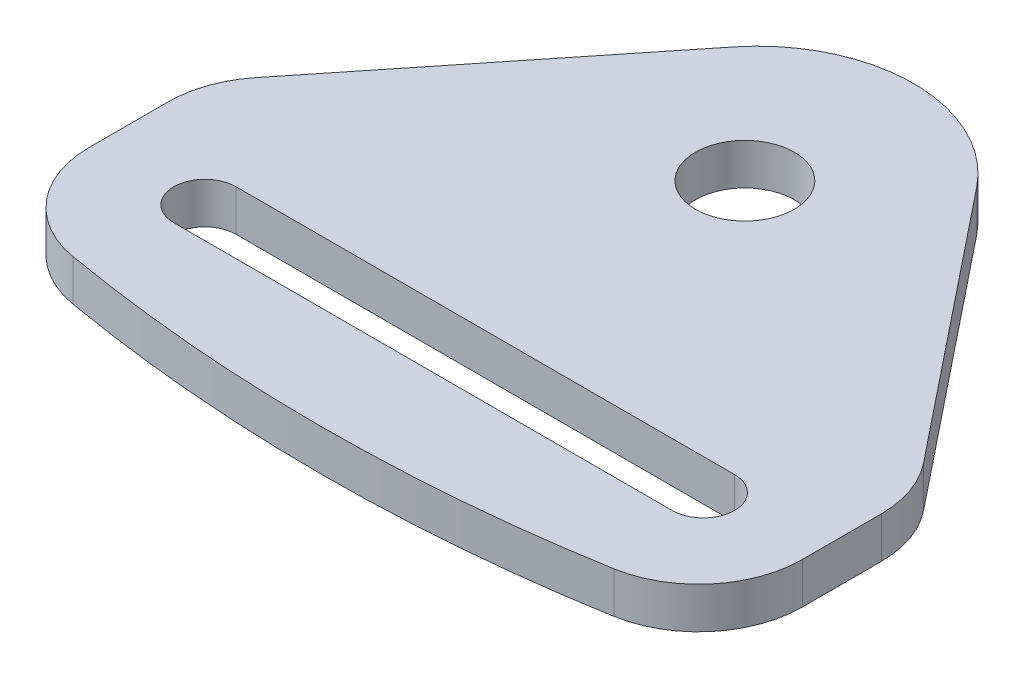
ISO-10303-21;
HEADER;
FILE_DESCRIPTION(('STEP AP214'),'2;1');
FILE_NAME('part.step','',(''),(''),'','','');
FILE_SCHEMA(('AUTOMOTIVE_DESIGN { 1 0 10303 214 1 1 1 1 }'));
ENDSEC;
DATA;
#1=APPLICATION_CONTEXT('core data for automotive mechanical design processes');
#2=APPLICATION_PROTOCOL_DEFINITION('international standard','automotive_design',2000,#1);
#3=PRODUCT_CONTEXT('',#1,'mechanical');
#4=PRODUCT('Part','Part','',(#3));
#5=PRODUCT_RELATED_PRODUCT_CATEGORY('part','',(#4));
#6=PRODUCT_DEFINITION_FORMATION('','',#4);
#7=PRODUCT_DEFINITION_CONTEXT('part definition',#1,'design');
#8=PRODUCT_DEFINITION('design','',#6,#7);
#9=PRODUCT_DEFINITION_SHAPE('','',#8);
#10=(LENGTH_UNIT() NAMED_UNIT(*) SI_UNIT(.MILLI.,.METRE.));
#11=(NAMED_UNIT(*) PLANE_ANGLE_UNIT() SI_UNIT($,.RADIAN.));
#12=(NAMED_UNIT(*) SI_UNIT($,.STERADIAN.) SOLID_ANGLE_UNIT());
#13=UNCERTAINTY_MEASURE_WITH_UNIT(LENGTH_MEASURE(1.E-05),#10,'distance_accuracy_value','');
#14=(GEOMETRIC_REPRESENTATION_CONTEXT(3) GLOBAL_UNCERTAINTY_ASSIGNED_CONTEXT((#13)) GLOBAL_UNIT_ASSIGNED_CONTEXT((#10,
#11,#12)) REPRESENTATION_CONTEXT('',''));
#15=CARTESIAN_POINT('',(0.,0.,0.));
#16=DIRECTION('',(0.,0.,1.));
#17=DIRECTION('',(1.,0.,0.));
#18=AXIS2_PLACEMENT_3D('',#15,#16,#17);
#19=CARTESIAN_POINT('',(-34.35,3.96875,-149.090163011278));
#20=DIRECTION('',(0.,1.,0.));
#21=DIRECTION('',(0.,0.,1.));
#22=AXIS2_PLACEMENT_3D('',#19,#20,#21);
#23=PLANE('',#22);
#24=DIRECTION('',(1.,0.,0.));
#25=VECTOR('',#24,1.);
#26=CARTESIAN_POINT('',(-58.35,3.96875,-5.99999999999998));
#27=LINE('',#26,#25);
#28=CARTESIAN_POINT('',(-58.35,3.96875,-5.99999999999998));
#29=VERTEX_POINT('',#28);
#30=CARTESIAN_POINT('',(-10.35,3.96875,-5.99999999999998));
#31=VERTEX_POINT('',#30);
#32=EDGE_CURVE('E145',#29,#31,#27,.T.);
#33=ORIENTED_EDGE('',*,*,#32,.F.);
#34=CARTESIAN_POINT('',(-58.35,3.96875,-8.99999999999998));
#35=DIRECTION('',(0.,1.,0.));
#36=DIRECTION('',(0.,0.,1.));
#37=AXIS2_PLACEMENT_3D('',#34,#35,#36);
#38=CIRCLE('',#37,3.);
#39=CARTESIAN_POINT('',(-58.35,3.96875,-12.));
#40=VERTEX_POINT('',#39);
#41=EDGE_CURVE('E135',#40,#29,#38,.T.);
#42=ORIENTED_EDGE('',*,*,#41,.F.);
#43=DIRECTION('',(-1.,0.,0.));
#44=VECTOR('',#43,1.);
#45=CARTESIAN_POINT('',(-58.35,3.96875,-12.));
#46=LINE('',#45,#44);
#47=CARTESIAN_POINT('',(-10.35,3.96875,-12.));
#48=VERTEX_POINT('',#47);
#49=EDGE_CURVE('E161',#48,#40,#46,.T.);
#50=ORIENTED_EDGE('',*,*,#49,.F.);
#51=CARTESIAN_POINT('',(-10.35,3.96875,-8.99999999999998));
#52=DIRECTION('',(0.,1.,0.));
#53=DIRECTION('',(0.,0.,1.));
#54=AXIS2_PLACEMENT_3D('',#51,#52,#53);
#55=CIRCLE('',#54,3.);
#56=EDGE_CURVE('E159',#31,#48,#55,.T.);
#57=ORIENTED_EDGE('',*,*,#56,.F.);
#58=EDGE_LOOP('',(#33,#42,#50,#57));
#59=FACE_BOUND('',#58,.T.);
#60=DIRECTION('',(-0.624545454545455,0.,-0.78098846035432));
#61=VECTOR('',#60,1.);
#62=CARTESIAN_POINT('',(-34.35,3.96875,-62.2543653194876));
#63=LINE('',#62,#61);
#64=CARTESIAN_POINT('',(-2.19011539645679,3.96875,-22.0387195584058));
#65=VERTEX_POINT('',#64);
#66=CARTESIAN_POINT('',(-22.6351730946852,3.96875,-47.6050798887611));
#67=VERTEX_POINT('',#66);
#68=EDGE_CURVE('E186',#65,#67,#63,.T.);
#69=ORIENTED_EDGE('',*,*,#68,.T.);
#70=CARTESIAN_POINT('',(-34.35,3.96875,-38.2368980705793));
#71=DIRECTION('',(0.,1.,0.));
#72=DIRECTION('',(0.,0.,1.));
#73=AXIS2_PLACEMENT_3D('',#70,#71,#72);
#74=CIRCLE('',#73,15.);
#75=CARTESIAN_POINT('',(-46.0648269053148,3.96875,-47.6050798887611));
#76=VERTEX_POINT('',#75);
#77=EDGE_CURVE('E11',#67,#76,#74,.T.);
#78=ORIENTED_EDGE('',*,*,#77,.T.);
#79=DIRECTION('',(-0.624545454545455,0.,0.78098846035432));
#80=VECTOR('',#79,1.);
#81=CARTESIAN_POINT('',(-68.7,3.96875,-19.3));
#82=LINE('',#81,#80);
#83=CARTESIAN_POINT('',(-66.5098846035432,3.96875,-22.0387195584058));
#84=VERTEX_POINT('',#83);
#85=EDGE_CURVE('E188',#76,#84,#82,.T.);
#86=ORIENTED_EDGE('',*,*,#85,.T.);
#87=CARTESIAN_POINT('',(-58.7,3.96875,-15.7932650129513));
#88=DIRECTION('',(0.,1.,0.));
#89=DIRECTION('',(0.,0.,1.));
#90=AXIS2_PLACEMENT_3D('',#87,#88,#89);
#91=CIRCLE('',#90,10.);
#92=CARTESIAN_POINT('',(-68.7,3.96875,-15.7932650129513));
#93=VERTEX_POINT('',#92);
#94=EDGE_CURVE('E225',#84,#93,#91,.T.);
#95=ORIENTED_EDGE('',*,*,#94,.T.);
#96=DIRECTION('',(0.,0.,1.));
#97=VECTOR('',#96,1.);
#98=CARTESIAN_POINT('',(-68.7,3.96875,0.));
#99=LINE('',#98,#97);
#100=CARTESIAN_POINT('',(-68.7,3.96875,-8.18255075787189));
#101=VERTEX_POINT('',#100);
#102=EDGE_CURVE('E190',#93,#101,#99,.T.);
#103=ORIENTED_EDGE('',*,*,#102,.T.);
#104=CARTESIAN_POINT('',(-58.7,3.96875,-8.18255075787189));
#105=DIRECTION('',(0.,1.,0.));
#106=DIRECTION('',(0.,0.,1.));
#107=AXIS2_PLACEMENT_3D('',#104,#105,#106);
#108=CIRCLE('',#107,10.);
#109=CARTESIAN_POINT('',(-60.402843932304,3.96875,1.6713988331406));
#110=VERTEX_POINT('',#109);
#111=EDGE_CURVE('E223',#101,#110,#108,.T.);
#112=ORIENTED_EDGE('',*,*,#111,.T.);
#113=CARTESIAN_POINT('',(-34.35,3.96875,-149.090163011278));
#114=DIRECTION('',(0.,1.,0.));
#115=DIRECTION('',(0.,0.,1.));
#116=AXIS2_PLACEMENT_3D('',#113,#114,#115);
#117=CIRCLE('',#116,152.99607578866);
#118=CARTESIAN_POINT('',(-8.29715606769602,3.96875,1.6713988331406));
#119=VERTEX_POINT('',#118);
#120=EDGE_CURVE('E179',#110,#119,#117,.T.);
#121=ORIENTED_EDGE('',*,*,#120,.T.);
#122=CARTESIAN_POINT('',(-10.,3.96875,-8.18255075787189));
#123=DIRECTION('',(0.,1.,0.));
#124=DIRECTION('',(0.,0.,1.));
#125=AXIS2_PLACEMENT_3D('',#122,#123,#124);
#126=CIRCLE('',#125,10.);
#127=CARTESIAN_POINT('',(0.,3.96875,-8.18255075787189));
#128=VERTEX_POINT('',#127);
#129=EDGE_CURVE('E221',#119,#128,#126,.T.);
#130=ORIENTED_EDGE('',*,*,#129,.T.);
#131=DIRECTION('',(0.,0.,-1.));
#132=VECTOR('',#131,1.);
#133=CARTESIAN_POINT('',(0.,3.96875,0.));
#134=LINE('',#133,#132);
#135=CARTESIAN_POINT('',(0.,3.96875,-15.7932650129513));
#136=VERTEX_POINT('',#135);
#137=EDGE_CURVE('E182',#128,#136,#134,.T.);
#138=ORIENTED_EDGE('',*,*,#137,.T.);
#139=CARTESIAN_POINT('',(-10.,3.96875,-15.7932650129513));
#140=DIRECTION('',(0.,1.,0.));
#141=DIRECTION('',(0.,0.,1.));
#142=AXIS2_PLACEMENT_3D('',#139,#140,#141);
#143=CIRCLE('',#142,10.);
#144=EDGE_CURVE('E227',#136,#65,#143,.T.);
#145=ORIENTED_EDGE('',*,*,#144,.T.);
#146=EDGE_LOOP('',(#69,#78,#86,#95,#103,#112,#121,#130,#138,#145));
#147=FACE_BOUND('',#146,.T.);
#148=CARTESIAN_POINT('',(-34.35,3.96875,-37.));
#149=DIRECTION('',(0.,1.,0.));
#150=DIRECTION('',(0.,0.,1.));
#151=AXIS2_PLACEMENT_3D('',#148,#149,#150);
#152=CIRCLE('',#151,4.7625);
#153=CARTESIAN_POINT('',(-34.35,3.96875,-32.2375));
#154=VERTEX_POINT('',#153);
#155=EDGE_CURVE('E168',#154,#154,#152,.T.);
#156=ORIENTED_EDGE('',*,*,#155,.F.);
#157=EDGE_LOOP('',(#156));
#158=FACE_BOUND('',#157,.T.);
#159=ADVANCED_FACE('F33',(#59,#147,#158),#23,.T.);
#160=CARTESIAN_POINT('',(-34.35,0.,-149.090163011278));
#161=DIRECTION('',(0.,1.,0.));
#162=DIRECTION('',(0.,0.,1.));
#163=AXIS2_PLACEMENT_3D('',#160,#161,#162);
#164=PLANE('',#163);
#165=DIRECTION('',(-0.624545454545455,0.,0.78098846035432));
#166=VECTOR('',#165,1.);
#167=CARTESIAN_POINT('',(-68.7,0.,-19.3));
#168=LINE('',#167,#166);
#169=CARTESIAN_POINT('',(-46.0648269053148,0.,-47.6050798887611));
#170=VERTEX_POINT('',#169);
#171=CARTESIAN_POINT('',(-66.5098846035432,0.,-22.0387195584058));
#172=VERTEX_POINT('',#171);
#173=EDGE_CURVE('E201',#170,#172,#168,.T.);
#174=ORIENTED_EDGE('',*,*,#173,.F.);
#175=CARTESIAN_POINT('',(-34.35,0.,-38.2368980705793));
#176=DIRECTION('',(0.,1.,0.));
#177=DIRECTION('',(0.,0.,1.));
#178=AXIS2_PLACEMENT_3D('',#175,#176,#177);
#179=CIRCLE('',#178,15.);
#180=CARTESIAN_POINT('',(-22.6351730946852,0.,-47.6050798887611));
#181=VERTEX_POINT('',#180);
#182=EDGE_CURVE('E55',#170,#181,#179,.F.);
#183=ORIENTED_EDGE('',*,*,#182,.T.);
#184=DIRECTION('',(-0.624545454545455,0.,-0.78098846035432));
#185=VECTOR('',#184,1.);
#186=CARTESIAN_POINT('',(-34.35,0.,-62.2543653194876));
#187=LINE('',#186,#185);
#188=CARTESIAN_POINT('',(-2.19011539645679,0.,-22.0387195584058));
#189=VERTEX_POINT('',#188);
#190=EDGE_CURVE('E199',#189,#181,#187,.T.);
#191=ORIENTED_EDGE('',*,*,#190,.F.);
#192=CARTESIAN_POINT('',(-10.,0.,-15.7932650129513));
#193=DIRECTION('',(0.,1.,0.));
#194=DIRECTION('',(0.,0.,1.));
#195=AXIS2_PLACEMENT_3D('',#192,#193,#194);
#196=CIRCLE('',#195,10.);
#197=CARTESIAN_POINT('',(0.,0.,-15.7932650129513));
#198=VERTEX_POINT('',#197);
#199=EDGE_CURVE('E214',#189,#198,#196,.F.);
#200=ORIENTED_EDGE('',*,*,#199,.T.);
#201=DIRECTION('',(0.,0.,-1.));
#202=VECTOR('',#201,1.);
#203=CARTESIAN_POINT('',(0.,0.,0.));
#204=LINE('',#203,#202);
#205=CARTESIAN_POINT('',(0.,0.,-8.18255075787189));
#206=VERTEX_POINT('',#205);
#207=EDGE_CURVE('E196',#206,#198,#204,.T.);
#208=ORIENTED_EDGE('',*,*,#207,.F.);
#209=CARTESIAN_POINT('',(-10.,0.,-8.18255075787189));
#210=DIRECTION('',(0.,1.,0.));
#211=DIRECTION('',(0.,0.,1.));
#212=AXIS2_PLACEMENT_3D('',#209,#210,#211);
#213=CIRCLE('',#212,10.);
#214=CARTESIAN_POINT('',(-8.29715606769602,0.,1.6713988331406));
#215=VERTEX_POINT('',#214);
#216=EDGE_CURVE('E207',#206,#215,#213,.F.);
#217=ORIENTED_EDGE('',*,*,#216,.T.);
#218=CARTESIAN_POINT('',(-34.35,0.,-149.090163011278));
#219=DIRECTION('',(0.,1.,0.));
#220=DIRECTION('',(0.,0.,1.));
#221=AXIS2_PLACEMENT_3D('',#218,#219,#220);
#222=CIRCLE('',#221,152.99607578866);
#223=CARTESIAN_POINT('',(-60.402843932304,0.,1.6713988331406));
#224=VERTEX_POINT('',#223);
#225=EDGE_CURVE('E153',#224,#215,#222,.T.);
#226=ORIENTED_EDGE('',*,*,#225,.F.);
#227=CARTESIAN_POINT('',(-58.7,0.,-8.18255075787189));
#228=DIRECTION('',(0.,1.,0.));
#229=DIRECTION('',(0.,0.,1.));
#230=AXIS2_PLACEMENT_3D('',#227,#228,#229);
#231=CIRCLE('',#230,10.);
#232=CARTESIAN_POINT('',(-68.7,0.,-8.18255075787189));
#233=VERTEX_POINT('',#232);
#234=EDGE_CURVE('E209',#224,#233,#231,.F.);
#235=ORIENTED_EDGE('',*,*,#234,.T.);
#236=DIRECTION('',(0.,0.,1.));
#237=VECTOR('',#236,1.);
#238=CARTESIAN_POINT('',(-68.7,0.,0.));
#239=LINE('',#238,#237);
#240=CARTESIAN_POINT('',(-68.7,0.,-15.7932650129513));
#241=VERTEX_POINT('',#240);
#242=EDGE_CURVE('E183',#241,#233,#239,.T.);
#243=ORIENTED_EDGE('',*,*,#242,.F.);
#244=CARTESIAN_POINT('',(-58.7,0.,-15.7932650129513));
#245=DIRECTION('',(0.,1.,0.));
#246=DIRECTION('',(0.,0.,1.));
#247=AXIS2_PLACEMENT_3D('',#244,#245,#246);
#248=CIRCLE('',#247,10.);
#249=EDGE_CURVE('E211',#241,#172,#248,.F.);
#250=ORIENTED_EDGE('',*,*,#249,.T.);
#251=EDGE_LOOP('',(#174,#183,#191,#200,#208,#217,#226,#235,#243,#250));
#252=FACE_BOUND('',#251,.T.);
#253=CARTESIAN_POINT('',(-58.35,0.,-8.99999999999998));
#254=DIRECTION('',(0.,1.,0.));
#255=DIRECTION('',(0.,0.,1.));
#256=AXIS2_PLACEMENT_3D('',#253,#254,#255);
#257=CIRCLE('',#256,3.);
#258=CARTESIAN_POINT('',(-58.35,0.,-12.));
#259=VERTEX_POINT('',#258);
#260=CARTESIAN_POINT('',(-58.35,0.,-5.99999999999998));
#261=VERTEX_POINT('',#260);
#262=EDGE_CURVE('E166',#259,#261,#257,.T.);
#263=ORIENTED_EDGE('',*,*,#262,.T.);
#264=DIRECTION('',(1.,0.,0.));
#265=VECTOR('',#264,1.);
#266=CARTESIAN_POINT('',(-58.35,0.,-5.99999999999998));
#267=LINE('',#266,#265);
#268=CARTESIAN_POINT('',(-10.35,0.,-5.99999999999998));
#269=VERTEX_POINT('',#268);
#270=EDGE_CURVE('E152',#261,#269,#267,.T.);
#271=ORIENTED_EDGE('',*,*,#270,.T.);
#272=CARTESIAN_POINT('',(-10.35,0.,-8.99999999999998));
#273=DIRECTION('',(0.,1.,0.));
#274=DIRECTION('',(0.,0.,1.));
#275=AXIS2_PLACEMENT_3D('',#272,#273,#274);
#276=CIRCLE('',#275,3.);
#277=CARTESIAN_POINT('',(-10.35,0.,-12.));
#278=VERTEX_POINT('',#277);
#279=EDGE_CURVE('E170',#269,#278,#276,.T.);
#280=ORIENTED_EDGE('',*,*,#279,.T.);
#281=DIRECTION('',(-1.,0.,0.));
#282=VECTOR('',#281,1.);
#283=CARTESIAN_POINT('',(-58.35,0.,-12.));
#284=LINE('',#283,#282);
#285=EDGE_CURVE('E146',#278,#259,#284,.T.);
#286=ORIENTED_EDGE('',*,*,#285,.T.);
#287=EDGE_LOOP('',(#263,#271,#280,#286));
#288=FACE_BOUND('',#287,.T.);
#289=CARTESIAN_POINT('',(-34.35,0.,-37.));
#290=DIRECTION('',(0.,1.,0.));
#291=DIRECTION('',(0.,0.,1.));
#292=AXIS2_PLACEMENT_3D('',#289,#290,#291);
#293=CIRCLE('',#292,4.7625);
#294=CARTESIAN_POINT('',(-34.35,0.,-32.2375));
#295=VERTEX_POINT('',#294);
#296=EDGE_CURVE('E432',#295,#295,#293,.T.);
#297=ORIENTED_EDGE('',*,*,#296,.T.);
#298=EDGE_LOOP('',(#297));
#299=FACE_BOUND('',#298,.T.);
#300=ADVANCED_FACE('F251',(#252,#288,#299),#164,.F.);
#301=CARTESIAN_POINT('',(-34.35,3.96875,-149.090163011278));
#302=DIRECTION('',(0.,-1.,0.));
#303=DIRECTION('',(0.,0.,-1.));
#304=AXIS2_PLACEMENT_3D('',#301,#302,#303);
#305=CYLINDRICAL_SURFACE('',#304,152.99607578866);
#306=ORIENTED_EDGE('',*,*,#120,.F.);
#307=DIRECTION('',(0.,-1.,0.));
#308=VECTOR('',#307,1.);
#309=CARTESIAN_POINT('',(-60.402843932304,3.96875,1.6713988331406));
#310=LINE('',#309,#308);
#311=EDGE_CURVE('E239',#110,#224,#310,.T.);
#312=ORIENTED_EDGE('',*,*,#311,.T.);
#313=ORIENTED_EDGE('',*,*,#225,.T.);
#314=DIRECTION('',(0.,-1.,0.));
#315=VECTOR('',#314,1.);
#316=CARTESIAN_POINT('',(-8.29715606769602,3.96875,1.6713988331406));
#317=LINE('',#316,#315);
#318=EDGE_CURVE('E237',#215,#119,#317,.F.);
#319=ORIENTED_EDGE('',*,*,#318,.T.);
#320=EDGE_LOOP('',(#306,#312,#313,#319));
#321=FACE_BOUND('',#320,.T.);
#322=ADVANCED_FACE('F271',(#321),#305,.T.);
#323=CARTESIAN_POINT('',(0.,3.96875,0.));
#324=DIRECTION('',(-1.,0.,0.));
#325=DIRECTION('',(0.,0.,1.));
#326=AXIS2_PLACEMENT_3D('',#323,#324,#325);
#327=PLANE('',#326);
#328=ORIENTED_EDGE('',*,*,#207,.T.);
#329=DIRECTION('',(0.,-1.,0.));
#330=VECTOR('',#329,1.);
#331=CARTESIAN_POINT('',(0.,3.96875,-15.7932650129513));
#332=LINE('',#331,#330);
#333=EDGE_CURVE('E219',#198,#136,#332,.F.);
#334=ORIENTED_EDGE('',*,*,#333,.T.);
#335=ORIENTED_EDGE('',*,*,#137,.F.);
#336=DIRECTION('',(0.,-1.,0.));
#337=VECTOR('',#336,1.);
#338=CARTESIAN_POINT('',(0.,3.96875,-8.18255075787189));
#339=LINE('',#338,#337);
#340=EDGE_CURVE('E216',#128,#206,#339,.T.);
#341=ORIENTED_EDGE('',*,*,#340,.T.);
#342=EDGE_LOOP('',(#328,#334,#335,#341));
#343=FACE_BOUND('',#342,.T.);
#344=ADVANCED_FACE('F280',(#343),#327,.F.);
#345=CARTESIAN_POINT('',(-34.35,3.96875,-62.2543653194876));
#346=DIRECTION('',(-0.78098846035432,0.,0.624545454545455));
#347=DIRECTION('',(0.624545454545455,0.,0.78098846035432));
#348=AXIS2_PLACEMENT_3D('',#345,#346,#347);
#349=PLANE('',#348);
#350=ORIENTED_EDGE('',*,*,#190,.T.);
#351=DIRECTION('',(0.,-1.,0.));
#352=VECTOR('',#351,1.);
#353=CARTESIAN_POINT('',(-22.6351730946852,3.96875,-47.6050798887611));
#354=LINE('',#353,#352);
#355=EDGE_CURVE('E41',#181,#67,#354,.F.);
#356=ORIENTED_EDGE('',*,*,#355,.T.);
#357=ORIENTED_EDGE('',*,*,#68,.F.);
#358=DIRECTION('',(0.,-1.,0.));
#359=VECTOR('',#358,1.);
#360=CARTESIAN_POINT('',(-2.1901153964568,3.96875,-22.0387195584058));
#361=LINE('',#360,#359);
#362=EDGE_CURVE('E193',#65,#189,#361,.T.);
#363=ORIENTED_EDGE('',*,*,#362,.T.);
#364=EDGE_LOOP('',(#350,#356,#357,#363));
#365=FACE_BOUND('',#364,.T.);
#366=ADVANCED_FACE('F286',(#365),#349,.F.);
#367=CARTESIAN_POINT('',(-68.7,3.96875,-19.3));
#368=DIRECTION('',(0.78098846035432,0.,0.624545454545455));
#369=DIRECTION('',(0.624545454545455,0.,-0.78098846035432));
#370=AXIS2_PLACEMENT_3D('',#367,#368,#369);
#371=PLANE('',#370);
#372=ORIENTED_EDGE('',*,*,#85,.F.);
#373=DIRECTION('',(0.,-1.,0.));
#374=VECTOR('',#373,1.);
#375=CARTESIAN_POINT('',(-46.0648269053148,3.96875,-47.6050798887611));
#376=LINE('',#375,#374);
#377=EDGE_CURVE('E242',#76,#170,#376,.T.);
#378=ORIENTED_EDGE('',*,*,#377,.T.);
#379=ORIENTED_EDGE('',*,*,#173,.T.);
#380=DIRECTION('',(0.,-1.,0.));
#381=VECTOR('',#380,1.);
#382=CARTESIAN_POINT('',(-66.5098846035432,3.96875,-22.0387195584058));
#383=LINE('',#382,#381);
#384=EDGE_CURVE('E234',#172,#84,#383,.F.);
#385=ORIENTED_EDGE('',*,*,#384,.T.);
#386=EDGE_LOOP('',(#372,#378,#379,#385));
#387=FACE_BOUND('',#386,.T.);
#388=ADVANCED_FACE('F248',(#387),#371,.F.);
#389=CARTESIAN_POINT('',(-68.7,3.96875,0.));
#390=DIRECTION('',(1.,0.,0.));
#391=DIRECTION('',(0.,0.,-1.));
#392=AXIS2_PLACEMENT_3D('',#389,#390,#391);
#393=PLANE('',#392);
#394=ORIENTED_EDGE('',*,*,#102,.F.);
#395=DIRECTION('',(0.,-1.,0.));
#396=VECTOR('',#395,1.);
#397=CARTESIAN_POINT('',(-68.7,3.96875,-15.7932650129513));
#398=LINE('',#397,#396);
#399=EDGE_CURVE('E231',#93,#241,#398,.T.);
#400=ORIENTED_EDGE('',*,*,#399,.T.);
#401=ORIENTED_EDGE('',*,*,#242,.T.);
#402=DIRECTION('',(0.,-1.,0.));
#403=VECTOR('',#402,1.);
#404=CARTESIAN_POINT('',(-68.7,3.96875,-8.18255075787189));
#405=LINE('',#404,#403);
#406=EDGE_CURVE('E229',#233,#101,#405,.F.);
#407=ORIENTED_EDGE('',*,*,#406,.T.);
#408=EDGE_LOOP('',(#394,#400,#401,#407));
#409=FACE_BOUND('',#408,.T.);
#410=ADVANCED_FACE('F263',(#409),#393,.F.);
#411=CARTESIAN_POINT('',(-58.35,3.96875,-8.99999999999998));
#412=DIRECTION('',(0.,-1.,0.));
#413=DIRECTION('',(0.,0.,-1.));
#414=AXIS2_PLACEMENT_3D('',#411,#412,#413);
#415=CYLINDRICAL_SURFACE('',#414,3.);
#416=ORIENTED_EDGE('',*,*,#262,.F.);
#417=DIRECTION('',(0.,-1.,0.));
#418=VECTOR('',#417,1.);
#419=CARTESIAN_POINT('',(-58.35,3.96875,-12.));
#420=LINE('',#419,#418);
#421=EDGE_CURVE('E141',#40,#259,#420,.T.);
#422=ORIENTED_EDGE('',*,*,#421,.F.);
#423=ORIENTED_EDGE('',*,*,#41,.T.);
#424=DIRECTION('',(0.,-1.,0.));
#425=VECTOR('',#424,1.);
#426=CARTESIAN_POINT('',(-58.35,3.96875,-5.99999999999998));
#427=LINE('',#426,#425);
#428=EDGE_CURVE('E138',#29,#261,#427,.T.);
#429=ORIENTED_EDGE('',*,*,#428,.T.);
#430=EDGE_LOOP('',(#416,#422,#423,#429));
#431=FACE_BOUND('',#430,.T.);
#432=ADVANCED_FACE('F137',(#431),#415,.F.);
#433=CARTESIAN_POINT('',(-58.35,3.96875,-5.99999999999998));
#434=DIRECTION('',(0.,0.,-1.));
#435=DIRECTION('',(-1.,0.,0.));
#436=AXIS2_PLACEMENT_3D('',#433,#434,#435);
#437=PLANE('',#436);
#438=ORIENTED_EDGE('',*,*,#270,.F.);
#439=ORIENTED_EDGE('',*,*,#428,.F.);
#440=ORIENTED_EDGE('',*,*,#32,.T.);
#441=DIRECTION('',(0.,-1.,0.));
#442=VECTOR('',#441,1.);
#443=CARTESIAN_POINT('',(-10.35,3.96875,-5.99999999999998));
#444=LINE('',#443,#442);
#445=EDGE_CURVE('E154',#31,#269,#444,.T.);
#446=ORIENTED_EDGE('',*,*,#445,.T.);
#447=EDGE_LOOP('',(#438,#439,#440,#446));
#448=FACE_BOUND('',#447,.T.);
#449=ADVANCED_FACE('F149',(#448),#437,.T.);
#450=CARTESIAN_POINT('',(-10.35,3.96875,-8.99999999999998));
#451=DIRECTION('',(0.,-1.,0.));
#452=DIRECTION('',(0.,0.,-1.));
#453=AXIS2_PLACEMENT_3D('',#450,#451,#452);
#454=CYLINDRICAL_SURFACE('',#453,3.);
#455=ORIENTED_EDGE('',*,*,#279,.F.);
#456=ORIENTED_EDGE('',*,*,#445,.F.);
#457=ORIENTED_EDGE('',*,*,#56,.T.);
#458=DIRECTION('',(0.,-1.,0.));
#459=VECTOR('',#458,1.);
#460=CARTESIAN_POINT('',(-10.35,3.96875,-12.));
#461=LINE('',#460,#459);
#462=EDGE_CURVE('E176',#48,#278,#461,.T.);
#463=ORIENTED_EDGE('',*,*,#462,.T.);
#464=EDGE_LOOP('',(#455,#456,#457,#463));
#465=FACE_BOUND('',#464,.T.);
#466=ADVANCED_FACE('F371',(#465),#454,.F.);
#467=CARTESIAN_POINT('',(-58.35,3.96875,-12.));
#468=DIRECTION('',(0.,0.,1.));
#469=DIRECTION('',(1.,0.,0.));
#470=AXIS2_PLACEMENT_3D('',#467,#468,#469);
#471=PLANE('',#470);
#472=ORIENTED_EDGE('',*,*,#285,.F.);
#473=ORIENTED_EDGE('',*,*,#462,.F.);
#474=ORIENTED_EDGE('',*,*,#49,.T.);
#475=ORIENTED_EDGE('',*,*,#421,.T.);
#476=EDGE_LOOP('',(#472,#473,#474,#475));
#477=FACE_BOUND('',#476,.T.);
#478=ADVANCED_FACE('F377',(#477),#471,.T.);
#479=CARTESIAN_POINT('',(-34.35,3.96875,-37.));
#480=DIRECTION('',(0.,-1.,0.));
#481=DIRECTION('',(0.,0.,-1.));
#482=AXIS2_PLACEMENT_3D('',#479,#480,#481);
#483=CYLINDRICAL_SURFACE('',#482,4.7625);
#484=ORIENTED_EDGE('',*,*,#155,.T.);
#485=EDGE_LOOP('',(#484));
#486=FACE_BOUND('',#485,.T.);
#487=ORIENTED_EDGE('',*,*,#296,.F.);
#488=EDGE_LOOP('',(#487));
#489=FACE_BOUND('',#488,.T.);
#490=ADVANCED_FACE('F312',(#486,#489),#483,.F.);
#491=CARTESIAN_POINT('',(-10.,3.96875,-15.7932650129513));
#492=DIRECTION('',(0.,-1.,0.));
#493=DIRECTION('',(0.,0.,-1.));
#494=AXIS2_PLACEMENT_3D('',#491,#492,#493);
#495=CYLINDRICAL_SURFACE('',#494,10.);
#496=ORIENTED_EDGE('',*,*,#144,.F.);
#497=ORIENTED_EDGE('',*,*,#333,.F.);
#498=ORIENTED_EDGE('',*,*,#199,.F.);
#499=ORIENTED_EDGE('',*,*,#362,.F.);
#500=EDGE_LOOP('',(#496,#497,#498,#499));
#501=FACE_BOUND('',#500,.T.);
#502=ADVANCED_FACE('F284',(#501),#495,.T.);
#503=CARTESIAN_POINT('',(-58.7,3.96875,-15.7932650129513));
#504=DIRECTION('',(0.,-1.,0.));
#505=DIRECTION('',(0.,0.,-1.));
#506=AXIS2_PLACEMENT_3D('',#503,#504,#505);
#507=CYLINDRICAL_SURFACE('',#506,10.);
#508=ORIENTED_EDGE('',*,*,#94,.F.);
#509=ORIENTED_EDGE('',*,*,#384,.F.);
#510=ORIENTED_EDGE('',*,*,#249,.F.);
#511=ORIENTED_EDGE('',*,*,#399,.F.);
#512=EDGE_LOOP('',(#508,#509,#510,#511));
#513=FACE_BOUND('',#512,.T.);
#514=ADVANCED_FACE('F258',(#513),#507,.T.);
#515=CARTESIAN_POINT('',(-58.7,3.96875,-8.18255075787189));
#516=DIRECTION('',(0.,-1.,0.));
#517=DIRECTION('',(0.,0.,-1.));
#518=AXIS2_PLACEMENT_3D('',#515,#516,#517);
#519=CYLINDRICAL_SURFACE('',#518,10.);
#520=ORIENTED_EDGE('',*,*,#111,.F.);
#521=ORIENTED_EDGE('',*,*,#406,.F.);
#522=ORIENTED_EDGE('',*,*,#234,.F.);
#523=ORIENTED_EDGE('',*,*,#311,.F.);
#524=EDGE_LOOP('',(#520,#521,#522,#523));
#525=FACE_BOUND('',#524,.T.);
#526=ADVANCED_FACE('F266',(#525),#519,.T.);
#527=CARTESIAN_POINT('',(-10.,3.96875,-8.18255075787189));
#528=DIRECTION('',(0.,-1.,0.));
#529=DIRECTION('',(0.,0.,-1.));
#530=AXIS2_PLACEMENT_3D('',#527,#528,#529);
#531=CYLINDRICAL_SURFACE('',#530,10.);
#532=ORIENTED_EDGE('',*,*,#129,.F.);
#533=ORIENTED_EDGE('',*,*,#318,.F.);
#534=ORIENTED_EDGE('',*,*,#216,.F.);
#535=ORIENTED_EDGE('',*,*,#340,.F.);
#536=EDGE_LOOP('',(#532,#533,#534,#535));
#537=FACE_BOUND('',#536,.T.);
#538=ADVANCED_FACE('F275',(#537),#531,.T.);
#539=CARTESIAN_POINT('',(-34.35,3.96875,-38.2368980705793));
#540=DIRECTION('',(0.,-1.,0.));
#541=DIRECTION('',(0.,0.,-1.));
#542=AXIS2_PLACEMENT_3D('',#539,#540,#541);
#543=CYLINDRICAL_SURFACE('',#542,15.);
#544=ORIENTED_EDGE('',*,*,#77,.F.);
#545=ORIENTED_EDGE('',*,*,#355,.F.);
#546=ORIENTED_EDGE('',*,*,#182,.F.);
#547=ORIENTED_EDGE('',*,*,#377,.F.);
#548=EDGE_LOOP('',(#544,#545,#546,#547));
#549=FACE_BOUND('',#548,.T.);
#550=ADVANCED_FACE('F35',(#549),#543,.T.);
#551=CLOSED_SHELL('',(#159,#300,#322,#344,#366,#388,#410,#432,#449,#466,#478,#490,#502,#514,
#526,#538,#550));
#552=MANIFOLD_SOLID_BREP('B2',#551);
#553=ADVANCED_BREP_SHAPE_REPRESENTATION('',(#18,#552),#14);
#554=SHAPE_DEFINITION_REPRESENTATION(#9,#553);
ENDSEC;
END-ISO-10303-21;
